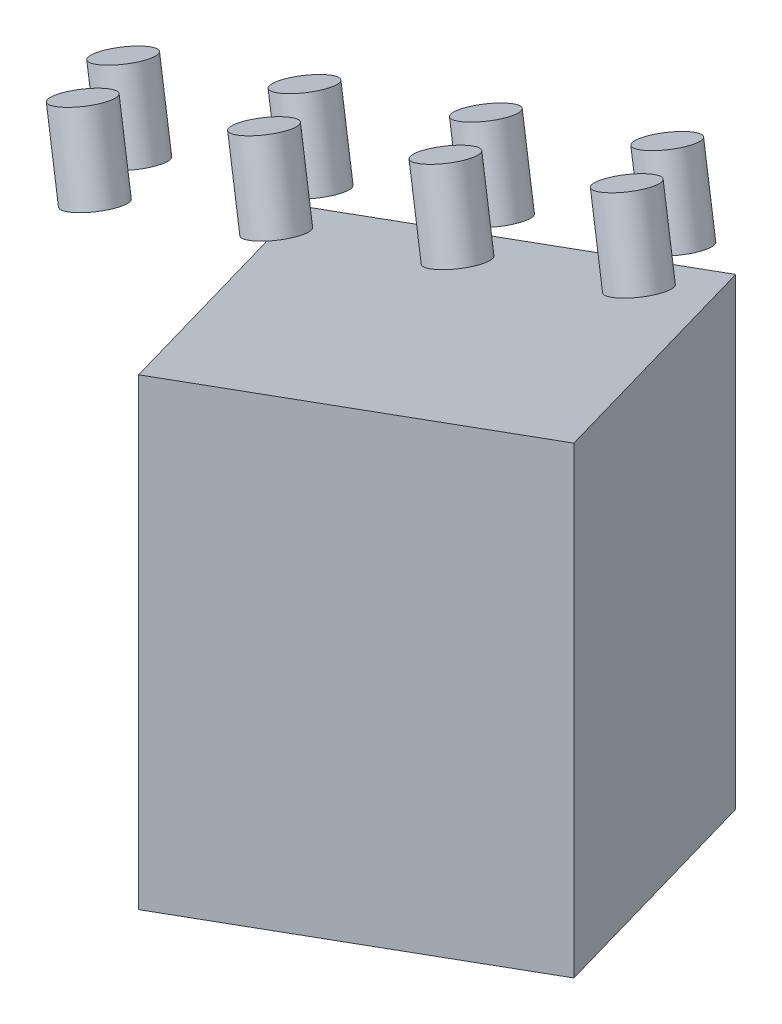
ISO-10303-21;
HEADER;
FILE_DESCRIPTION(('STEP AP214'),'2;1');
FILE_NAME('part.step','',(''),(''),'','','');
FILE_SCHEMA(('AUTOMOTIVE_DESIGN { 1 0 10303 214 1 1 1 1 }'));
ENDSEC;
DATA;
#1=APPLICATION_CONTEXT('core data for automotive mechanical design processes');
#2=APPLICATION_PROTOCOL_DEFINITION('international standard','automotive_design',2000,#1);
#3=PRODUCT_CONTEXT('',#1,'mechanical');
#4=PRODUCT('Part','Part','',(#3));
#5=PRODUCT_RELATED_PRODUCT_CATEGORY('part','',(#4));
#6=PRODUCT_DEFINITION_FORMATION('','',#4);
#7=PRODUCT_DEFINITION_CONTEXT('part definition',#1,'design');
#8=PRODUCT_DEFINITION('design','',#6,#7);
#9=PRODUCT_DEFINITION_SHAPE('','',#8);
#10=(LENGTH_UNIT() NAMED_UNIT(*) SI_UNIT(.MILLI.,.METRE.));
#11=(NAMED_UNIT(*) PLANE_ANGLE_UNIT() SI_UNIT($,.RADIAN.));
#12=(NAMED_UNIT(*) SI_UNIT($,.STERADIAN.) SOLID_ANGLE_UNIT());
#13=UNCERTAINTY_MEASURE_WITH_UNIT(LENGTH_MEASURE(1.E-05),#10,'distance_accuracy_value','');
#14=(GEOMETRIC_REPRESENTATION_CONTEXT(3) GLOBAL_UNCERTAINTY_ASSIGNED_CONTEXT((#13)) GLOBAL_UNIT_ASSIGNED_CONTEXT((#10,
#11,#12)) REPRESENTATION_CONTEXT('',''));
#15=CARTESIAN_POINT('',(0.,0.,0.));
#16=DIRECTION('',(0.,0.,1.));
#17=DIRECTION('',(1.,0.,0.));
#18=AXIS2_PLACEMENT_3D('',#15,#16,#17);
#19=CARTESIAN_POINT('',(-29.5986839364483,58.7634470395438,-6.62993275582684));
#20=DIRECTION('',(0.3365382859498,-0.924631341429047,0.178322361292947));
#21=DIRECTION('',(0.939692620785909,0.342020143325666,0.));
#22=AXIS2_PLACEMENT_3D('',#19,#20,#21);
#23=CYLINDRICAL_SURFACE('',#22,3.35836070254508);
#24=CARTESIAN_POINT('',(-29.5986839364483,58.7634470395438,-6.62993275582684));
#25=DIRECTION('',(-0.3365382859498,0.924631341429047,-0.178322361292947));
#26=DIRECTION('',(-0.939692620785909,-0.342020143325666,0.));
#27=AXIS2_PLACEMENT_3D('',#24,#25,#26);
#28=CIRCLE('',#27,3.35836070254508);
#29=CARTESIAN_POINT('',(-32.7545107065673,57.6148200307201,-6.62993275582684));
#30=VERTEX_POINT('',#29);
#31=EDGE_CURVE('E11',#30,#30,#28,.T.);
#32=ORIENTED_EDGE('',*,*,#31,.F.);
#33=EDGE_LOOP('',(#32));
#34=FACE_BOUND('',#33,.T.);
#35=CARTESIAN_POINT('',(-26.2333010769503,49.5171336252533,-4.84670914289737));
#36=DIRECTION('',(-0.3365382859498,0.924631341429047,-0.178322361292947));
#37=DIRECTION('',(-0.939692620785909,-0.342020143325666,0.));
#38=AXIS2_PLACEMENT_3D('',#35,#36,#37);
#39=CIRCLE('',#38,3.35836070254508);
#40=CARTESIAN_POINT('',(-29.3891278470693,48.3685066164296,-4.84670914289737));
#41=VERTEX_POINT('',#40);
#42=EDGE_CURVE('E49',#41,#41,#39,.T.);
#43=ORIENTED_EDGE('',*,*,#42,.T.);
#44=EDGE_LOOP('',(#43));
#45=FACE_BOUND('',#44,.T.);
#46=ADVANCED_FACE('F46',(#34,#45),#23,.T.);
#47=CARTESIAN_POINT('',(-29.5986839364483,58.7634470395438,-6.62993275582684));
#48=DIRECTION('',(-0.3365382859498,0.924631341429047,-0.178322361292947));
#49=DIRECTION('',(-0.939692620785909,-0.342020143325666,0.));
#50=AXIS2_PLACEMENT_3D('',#47,#48,#49);
#51=PLANE('',#50);
#52=ORIENTED_EDGE('',*,*,#31,.T.);
#53=EDGE_LOOP('',(#52));
#54=FACE_BOUND('',#53,.T.);
#55=ADVANCED_FACE('F61',(#54),#51,.T.);
#56=CARTESIAN_POINT('',(-26.2333010769503,49.5171336252533,-4.84670914289737));
#57=DIRECTION('',(-0.3365382859498,0.924631341429047,-0.178322361292947));
#58=DIRECTION('',(-0.939692620785909,-0.342020143325666,0.));
#59=AXIS2_PLACEMENT_3D('',#56,#57,#58);
#60=PLANE('',#59);
#61=ORIENTED_EDGE('',*,*,#42,.F.);
#62=EDGE_LOOP('',(#61));
#63=FACE_BOUND('',#62,.T.);
#64=ADVANCED_FACE('F59',(#63),#60,.F.);
#65=CLOSED_SHELL('',(#46,#55,#64));
#66=MANIFOLD_SOLID_BREP('B2',#65);
#67=CARTESIAN_POINT('',(-22.550989280554,63.6982959646013,5.65734790850802));
#68=DIRECTION('',(0.3365382859498,-0.924631341429047,0.178322361292947));
#69=DIRECTION('',(0.939692620785909,0.342020143325666,0.));
#70=AXIS2_PLACEMENT_3D('',#67,#68,#69);
#71=CYLINDRICAL_SURFACE('',#70,3.35836070254508);
#72=CARTESIAN_POINT('',(-22.550989280554,63.6982959646013,5.65734790850802));
#73=DIRECTION('',(-0.3365382859498,0.924631341429047,-0.178322361292947));
#74=DIRECTION('',(-0.939692620785909,-0.342020143325666,0.));
#75=AXIS2_PLACEMENT_3D('',#72,#73,#74);
#76=CIRCLE('',#75,3.35836070254508);
#77=CARTESIAN_POINT('',(-25.706816050673,62.5496689557776,5.65734790850802));
#78=VERTEX_POINT('',#77);
#79=EDGE_CURVE('E45',#78,#78,#76,.T.);
#80=ORIENTED_EDGE('',*,*,#79,.F.);
#81=EDGE_LOOP('',(#80));
#82=FACE_BOUND('',#81,.T.);
#83=CARTESIAN_POINT('',(-19.185606421056,54.4519825503108,7.44057152143749));
#84=DIRECTION('',(-0.3365382859498,0.924631341429047,-0.178322361292947));
#85=DIRECTION('',(-0.939692620785909,-0.342020143325666,0.));
#86=AXIS2_PLACEMENT_3D('',#83,#84,#85);
#87=CIRCLE('',#86,3.35836070254508);
#88=CARTESIAN_POINT('',(-22.3414331911749,53.3033555414871,7.44057152143749));
#89=VERTEX_POINT('',#88);
#90=EDGE_CURVE('E98',#89,#89,#87,.T.);
#91=ORIENTED_EDGE('',*,*,#90,.T.);
#92=EDGE_LOOP('',(#91));
#93=FACE_BOUND('',#92,.T.);
#94=ADVANCED_FACE('F95',(#82,#93),#71,.T.);
#95=CARTESIAN_POINT('',(-22.550989280554,63.6982959646013,5.65734790850802));
#96=DIRECTION('',(-0.3365382859498,0.924631341429047,-0.178322361292947));
#97=DIRECTION('',(-0.939692620785909,-0.342020143325666,0.));
#98=AXIS2_PLACEMENT_3D('',#95,#96,#97);
#99=PLANE('',#98);
#100=ORIENTED_EDGE('',*,*,#79,.T.);
#101=EDGE_LOOP('',(#100));
#102=FACE_BOUND('',#101,.T.);
#103=ADVANCED_FACE('F110',(#102),#99,.T.);
#104=CARTESIAN_POINT('',(-19.185606421056,54.4519825503108,7.44057152143749));
#105=DIRECTION('',(-0.3365382859498,0.924631341429047,-0.178322361292947));
#106=DIRECTION('',(-0.939692620785909,-0.342020143325666,0.));
#107=AXIS2_PLACEMENT_3D('',#104,#105,#106);
#108=PLANE('',#107);
#109=ORIENTED_EDGE('',*,*,#90,.F.);
#110=EDGE_LOOP('',(#109));
#111=FACE_BOUND('',#110,.T.);
#112=ADVANCED_FACE('F108',(#111),#108,.F.);
#113=CLOSED_SHELL('',(#94,#103,#112));
#114=MANIFOLD_SOLID_BREP('B6',#113);
#115=CARTESIAN_POINT('',(-6.10636841680053,67.3139506226855,-6.62993275582684));
#116=DIRECTION('',(0.3365382859498,-0.924631341429047,0.178322361292947));
#117=DIRECTION('',(0.939692620785909,0.342020143325666,0.));
#118=AXIS2_PLACEMENT_3D('',#115,#116,#117);
#119=CYLINDRICAL_SURFACE('',#118,3.35836070254508);
#120=CARTESIAN_POINT('',(-6.10636841680053,67.3139506226855,-6.62993275582684));
#121=DIRECTION('',(-0.3365382859498,0.924631341429047,-0.178322361292947));
#122=DIRECTION('',(-0.939692620785909,-0.342020143325666,0.));
#123=AXIS2_PLACEMENT_3D('',#120,#121,#122);
#124=CIRCLE('',#123,3.35836070254508);
#125=CARTESIAN_POINT('',(-9.26219518691953,66.1653236138617,-6.62993275582684));
#126=VERTEX_POINT('',#125);
#127=EDGE_CURVE('E94',#126,#126,#124,.T.);
#128=ORIENTED_EDGE('',*,*,#127,.F.);
#129=EDGE_LOOP('',(#128));
#130=FACE_BOUND('',#129,.T.);
#131=CARTESIAN_POINT('',(-2.74098555730253,58.067637208395,-4.84670914289737));
#132=DIRECTION('',(-0.3365382859498,0.924631341429047,-0.178322361292947));
#133=DIRECTION('',(-0.939692620785909,-0.342020143325666,0.));
#134=AXIS2_PLACEMENT_3D('',#131,#132,#133);
#135=CIRCLE('',#134,3.35836070254508);
#136=CARTESIAN_POINT('',(-5.89681232742153,56.9190101995712,-4.84670914289737));
#137=VERTEX_POINT('',#136);
#138=EDGE_CURVE('E147',#137,#137,#135,.T.);
#139=ORIENTED_EDGE('',*,*,#138,.T.);
#140=EDGE_LOOP('',(#139));
#141=FACE_BOUND('',#140,.T.);
#142=ADVANCED_FACE('F144',(#130,#141),#119,.T.);
#143=CARTESIAN_POINT('',(-6.10636841680053,67.3139506226855,-6.62993275582684));
#144=DIRECTION('',(-0.3365382859498,0.924631341429047,-0.178322361292947));
#145=DIRECTION('',(-0.939692620785909,-0.342020143325666,0.));
#146=AXIS2_PLACEMENT_3D('',#143,#144,#145);
#147=PLANE('',#146);
#148=ORIENTED_EDGE('',*,*,#127,.T.);
#149=EDGE_LOOP('',(#148));
#150=FACE_BOUND('',#149,.T.);
#151=ADVANCED_FACE('F159',(#150),#147,.T.);
#152=CARTESIAN_POINT('',(-2.74098555730253,58.067637208395,-4.84670914289737));
#153=DIRECTION('',(-0.3365382859498,0.924631341429047,-0.178322361292947));
#154=DIRECTION('',(-0.939692620785909,-0.342020143325666,0.));
#155=AXIS2_PLACEMENT_3D('',#152,#153,#154);
#156=PLANE('',#155);
#157=ORIENTED_EDGE('',*,*,#138,.F.);
#158=EDGE_LOOP('',(#157));
#159=FACE_BOUND('',#158,.T.);
#160=ADVANCED_FACE('F157',(#159),#156,.F.);
#161=CLOSED_SHELL('',(#142,#151,#160));
#162=MANIFOLD_SOLID_BREP('B40',#161);
#163=CARTESIAN_POINT('',(0.941326239093785,72.248799547743,5.65734790850802));
#164=DIRECTION('',(0.3365382859498,-0.924631341429047,0.178322361292947));
#165=DIRECTION('',(0.939692620785909,0.342020143325666,0.));
#166=AXIS2_PLACEMENT_3D('',#163,#164,#165);
#167=CYLINDRICAL_SURFACE('',#166,3.35836070254508);
#168=CARTESIAN_POINT('',(0.941326239093785,72.248799547743,5.65734790850802));
#169=DIRECTION('',(-0.3365382859498,0.924631341429047,-0.178322361292947));
#170=DIRECTION('',(-0.939692620785909,-0.342020143325666,0.));
#171=AXIS2_PLACEMENT_3D('',#168,#169,#170);
#172=CIRCLE('',#171,3.35836070254508);
#173=CARTESIAN_POINT('',(-2.21450053102521,71.1001725389192,5.65734790850802));
#174=VERTEX_POINT('',#173);
#175=EDGE_CURVE('E143',#174,#174,#172,.T.);
#176=ORIENTED_EDGE('',*,*,#175,.F.);
#177=EDGE_LOOP('',(#176));
#178=FACE_BOUND('',#177,.T.);
#179=CARTESIAN_POINT('',(4.30670909859179,63.0024861334525,7.44057152143749));
#180=DIRECTION('',(-0.3365382859498,0.924631341429047,-0.178322361292947));
#181=DIRECTION('',(-0.939692620785909,-0.342020143325666,0.));
#182=AXIS2_PLACEMENT_3D('',#179,#180,#181);
#183=CIRCLE('',#182,3.35836070254508);
#184=CARTESIAN_POINT('',(1.15088232847279,61.8538591246288,7.44057152143749));
#185=VERTEX_POINT('',#184);
#186=EDGE_CURVE('E196',#185,#185,#183,.T.);
#187=ORIENTED_EDGE('',*,*,#186,.T.);
#188=EDGE_LOOP('',(#187));
#189=FACE_BOUND('',#188,.T.);
#190=ADVANCED_FACE('F193',(#178,#189),#167,.T.);
#191=CARTESIAN_POINT('',(0.941326239093785,72.248799547743,5.65734790850802));
#192=DIRECTION('',(-0.3365382859498,0.924631341429047,-0.178322361292947));
#193=DIRECTION('',(-0.939692620785909,-0.342020143325666,0.));
#194=AXIS2_PLACEMENT_3D('',#191,#192,#193);
#195=PLANE('',#194);
#196=ORIENTED_EDGE('',*,*,#175,.T.);
#197=EDGE_LOOP('',(#196));
#198=FACE_BOUND('',#197,.T.);
#199=ADVANCED_FACE('F208',(#198),#195,.T.);
#200=CARTESIAN_POINT('',(4.30670909859179,63.0024861334525,7.44057152143749));
#201=DIRECTION('',(-0.3365382859498,0.924631341429047,-0.178322361292947));
#202=DIRECTION('',(-0.939692620785909,-0.342020143325666,0.));
#203=AXIS2_PLACEMENT_3D('',#200,#201,#202);
#204=PLANE('',#203);
#205=ORIENTED_EDGE('',*,*,#186,.F.);
#206=EDGE_LOOP('',(#205));
#207=FACE_BOUND('',#206,.T.);
#208=ADVANCED_FACE('F206',(#207),#204,.F.);
#209=CLOSED_SHELL('',(#190,#199,#208));
#210=MANIFOLD_SOLID_BREP('B89',#209);
#211=CARTESIAN_POINT('',(17.3859471028472,75.8644542058271,-6.62993275582684));
#212=DIRECTION('',(0.3365382859498,-0.924631341429047,0.178322361292947));
#213=DIRECTION('',(0.939692620785909,0.342020143325666,0.));
#214=AXIS2_PLACEMENT_3D('',#211,#212,#213);
#215=CYLINDRICAL_SURFACE('',#214,3.35836070254508);
#216=CARTESIAN_POINT('',(17.3859471028472,75.8644542058271,-6.62993275582684));
#217=DIRECTION('',(-0.3365382859498,0.924631341429047,-0.178322361292947));
#218=DIRECTION('',(-0.939692620785909,-0.342020143325666,0.));
#219=AXIS2_PLACEMENT_3D('',#216,#217,#218);
#220=CIRCLE('',#219,3.35836070254508);
#221=CARTESIAN_POINT('',(14.2301203327282,74.7158271970034,-6.62993275582684));
#222=VERTEX_POINT('',#221);
#223=EDGE_CURVE('E192',#222,#222,#220,.T.);
#224=ORIENTED_EDGE('',*,*,#223,.F.);
#225=EDGE_LOOP('',(#224));
#226=FACE_BOUND('',#225,.T.);
#227=CARTESIAN_POINT('',(20.7513299623452,66.6181407915367,-4.84670914289737));
#228=DIRECTION('',(-0.3365382859498,0.924631341429047,-0.178322361292947));
#229=DIRECTION('',(-0.939692620785909,-0.342020143325666,0.));
#230=AXIS2_PLACEMENT_3D('',#227,#228,#229);
#231=CIRCLE('',#230,3.35836070254508);
#232=CARTESIAN_POINT('',(17.5955031922262,65.4695137827129,-4.84670914289737));
#233=VERTEX_POINT('',#232);
#234=EDGE_CURVE('E245',#233,#233,#231,.T.);
#235=ORIENTED_EDGE('',*,*,#234,.T.);
#236=EDGE_LOOP('',(#235));
#237=FACE_BOUND('',#236,.T.);
#238=ADVANCED_FACE('F242',(#226,#237),#215,.T.);
#239=CARTESIAN_POINT('',(17.3859471028472,75.8644542058271,-6.62993275582684));
#240=DIRECTION('',(-0.3365382859498,0.924631341429047,-0.178322361292947));
#241=DIRECTION('',(-0.939692620785909,-0.342020143325666,0.));
#242=AXIS2_PLACEMENT_3D('',#239,#240,#241);
#243=PLANE('',#242);
#244=ORIENTED_EDGE('',*,*,#223,.T.);
#245=EDGE_LOOP('',(#244));
#246=FACE_BOUND('',#245,.T.);
#247=ADVANCED_FACE('F257',(#246),#243,.T.);
#248=CARTESIAN_POINT('',(20.7513299623452,66.6181407915367,-4.84670914289737));
#249=DIRECTION('',(-0.3365382859498,0.924631341429047,-0.178322361292947));
#250=DIRECTION('',(-0.939692620785909,-0.342020143325666,0.));
#251=AXIS2_PLACEMENT_3D('',#248,#249,#250);
#252=PLANE('',#251);
#253=ORIENTED_EDGE('',*,*,#234,.F.);
#254=EDGE_LOOP('',(#253));
#255=FACE_BOUND('',#254,.T.);
#256=ADVANCED_FACE('F255',(#255),#252,.F.);
#257=CLOSED_SHELL('',(#238,#247,#256));
#258=MANIFOLD_SOLID_BREP('B138',#257);
#259=CARTESIAN_POINT('',(24.4336417587415,80.7993031308846,5.65734790850802));
#260=DIRECTION('',(0.3365382859498,-0.924631341429047,0.178322361292947));
#261=DIRECTION('',(0.939692620785909,0.342020143325666,0.));
#262=AXIS2_PLACEMENT_3D('',#259,#260,#261);
#263=CYLINDRICAL_SURFACE('',#262,3.35836070254508);
#264=CARTESIAN_POINT('',(24.4336417587415,80.7993031308846,5.65734790850802));
#265=DIRECTION('',(-0.3365382859498,0.924631341429047,-0.178322361292947));
#266=DIRECTION('',(-0.939692620785909,-0.342020143325666,0.));
#267=AXIS2_PLACEMENT_3D('',#264,#265,#266);
#268=CIRCLE('',#267,3.35836070254508);
#269=CARTESIAN_POINT('',(21.2778149886225,79.6506761220609,5.65734790850802));
#270=VERTEX_POINT('',#269);
#271=EDGE_CURVE('E241',#270,#270,#268,.T.);
#272=ORIENTED_EDGE('',*,*,#271,.F.);
#273=EDGE_LOOP('',(#272));
#274=FACE_BOUND('',#273,.T.);
#275=CARTESIAN_POINT('',(27.7990246182395,71.5529897165942,7.44057152143749));
#276=DIRECTION('',(-0.3365382859498,0.924631341429047,-0.178322361292947));
#277=DIRECTION('',(-0.939692620785909,-0.342020143325666,0.));
#278=AXIS2_PLACEMENT_3D('',#275,#276,#277);
#279=CIRCLE('',#278,3.35836070254508);
#280=CARTESIAN_POINT('',(24.6431978481205,70.4043627077704,7.44057152143749));
#281=VERTEX_POINT('',#280);
#282=EDGE_CURVE('E294',#281,#281,#279,.T.);
#283=ORIENTED_EDGE('',*,*,#282,.T.);
#284=EDGE_LOOP('',(#283));
#285=FACE_BOUND('',#284,.T.);
#286=ADVANCED_FACE('F291',(#274,#285),#263,.T.);
#287=CARTESIAN_POINT('',(24.4336417587415,80.7993031308846,5.65734790850802));
#288=DIRECTION('',(-0.3365382859498,0.924631341429047,-0.178322361292947));
#289=DIRECTION('',(-0.939692620785909,-0.342020143325666,0.));
#290=AXIS2_PLACEMENT_3D('',#287,#288,#289);
#291=PLANE('',#290);
#292=ORIENTED_EDGE('',*,*,#271,.T.);
#293=EDGE_LOOP('',(#292));
#294=FACE_BOUND('',#293,.T.);
#295=ADVANCED_FACE('F306',(#294),#291,.T.);
#296=CARTESIAN_POINT('',(27.7990246182395,71.5529897165942,7.44057152143749));
#297=DIRECTION('',(-0.3365382859498,0.924631341429047,-0.178322361292947));
#298=DIRECTION('',(-0.939692620785909,-0.342020143325666,0.));
#299=AXIS2_PLACEMENT_3D('',#296,#297,#298);
#300=PLANE('',#299);
#301=ORIENTED_EDGE('',*,*,#282,.F.);
#302=EDGE_LOOP('',(#301));
#303=FACE_BOUND('',#302,.T.);
#304=ADVANCED_FACE('F304',(#303),#300,.F.);
#305=CLOSED_SHELL('',(#286,#295,#304));
#306=MANIFOLD_SOLID_BREP('B187',#305);
#307=CARTESIAN_POINT('',(40.8782626224949,84.4149577889688,-6.62993275582684));
#308=DIRECTION('',(0.3365382859498,-0.924631341429047,0.178322361292947));
#309=DIRECTION('',(0.939692620785909,0.342020143325666,0.));
#310=AXIS2_PLACEMENT_3D('',#307,#308,#309);
#311=CYLINDRICAL_SURFACE('',#310,3.35836070254508);
#312=CARTESIAN_POINT('',(40.8782626224949,84.4149577889688,-6.62993275582684));
#313=DIRECTION('',(-0.3365382859498,0.924631341429047,-0.178322361292947));
#314=DIRECTION('',(-0.939692620785909,-0.342020143325666,0.));
#315=AXIS2_PLACEMENT_3D('',#312,#313,#314);
#316=CIRCLE('',#315,3.35836070254508);
#317=CARTESIAN_POINT('',(37.7224358523759,83.266330780145,-6.62993275582684));
#318=VERTEX_POINT('',#317);
#319=EDGE_CURVE('E290',#318,#318,#316,.T.);
#320=ORIENTED_EDGE('',*,*,#319,.F.);
#321=EDGE_LOOP('',(#320));
#322=FACE_BOUND('',#321,.T.);
#323=CARTESIAN_POINT('',(44.2436454819929,75.1686443746783,-4.84670914289737));
#324=DIRECTION('',(-0.3365382859498,0.924631341429047,-0.178322361292947));
#325=DIRECTION('',(-0.939692620785909,-0.342020143325666,0.));
#326=AXIS2_PLACEMENT_3D('',#323,#324,#325);
#327=CIRCLE('',#326,3.35836070254508);
#328=CARTESIAN_POINT('',(41.087818711874,74.0200173658545,-4.84670914289737));
#329=VERTEX_POINT('',#328);
#330=EDGE_CURVE('E343',#329,#329,#327,.T.);
#331=ORIENTED_EDGE('',*,*,#330,.T.);
#332=EDGE_LOOP('',(#331));
#333=FACE_BOUND('',#332,.T.);
#334=ADVANCED_FACE('F340',(#322,#333),#311,.T.);
#335=CARTESIAN_POINT('',(40.8782626224949,84.4149577889688,-6.62993275582684));
#336=DIRECTION('',(-0.3365382859498,0.924631341429047,-0.178322361292947));
#337=DIRECTION('',(-0.939692620785909,-0.342020143325666,0.));
#338=AXIS2_PLACEMENT_3D('',#335,#336,#337);
#339=PLANE('',#338);
#340=ORIENTED_EDGE('',*,*,#319,.T.);
#341=EDGE_LOOP('',(#340));
#342=FACE_BOUND('',#341,.T.);
#343=ADVANCED_FACE('F355',(#342),#339,.T.);
#344=CARTESIAN_POINT('',(44.2436454819929,75.1686443746783,-4.84670914289737));
#345=DIRECTION('',(-0.3365382859498,0.924631341429047,-0.178322361292947));
#346=DIRECTION('',(-0.939692620785909,-0.342020143325666,0.));
#347=AXIS2_PLACEMENT_3D('',#344,#345,#346);
#348=PLANE('',#347);
#349=ORIENTED_EDGE('',*,*,#330,.F.);
#350=EDGE_LOOP('',(#349));
#351=FACE_BOUND('',#350,.T.);
#352=ADVANCED_FACE('F353',(#351),#348,.F.);
#353=CLOSED_SHELL('',(#334,#343,#352));
#354=MANIFOLD_SOLID_BREP('B236',#353);
#355=CARTESIAN_POINT('',(47.9259572783893,89.3498067140263,5.65734790850802));
#356=DIRECTION('',(0.3365382859498,-0.924631341429047,0.178322361292947));
#357=DIRECTION('',(0.939692620785909,0.342020143325666,0.));
#358=AXIS2_PLACEMENT_3D('',#355,#356,#357);
#359=CYLINDRICAL_SURFACE('',#358,3.35836070254508);
#360=CARTESIAN_POINT('',(47.9259572783893,89.3498067140263,5.65734790850802));
#361=DIRECTION('',(-0.3365382859498,0.924631341429047,-0.178322361292947));
#362=DIRECTION('',(-0.939692620785909,-0.342020143325666,0.));
#363=AXIS2_PLACEMENT_3D('',#360,#361,#362);
#364=CIRCLE('',#363,3.35836070254508);
#365=CARTESIAN_POINT('',(44.7701305082703,88.2011797052025,5.65734790850802));
#366=VERTEX_POINT('',#365);
#367=EDGE_CURVE('E339',#366,#366,#364,.T.);
#368=ORIENTED_EDGE('',*,*,#367,.F.);
#369=EDGE_LOOP('',(#368));
#370=FACE_BOUND('',#369,.T.);
#371=CARTESIAN_POINT('',(51.2913401378873,80.1034932997358,7.44057152143749));
#372=DIRECTION('',(-0.3365382859498,0.924631341429047,-0.178322361292947));
#373=DIRECTION('',(-0.939692620785909,-0.342020143325666,0.));
#374=AXIS2_PLACEMENT_3D('',#371,#372,#373);
#375=CIRCLE('',#374,3.35836070254508);
#376=CARTESIAN_POINT('',(48.1355133677683,78.9548662909121,7.44057152143749));
#377=VERTEX_POINT('',#376);
#378=EDGE_CURVE('E392',#377,#377,#375,.T.);
#379=ORIENTED_EDGE('',*,*,#378,.T.);
#380=EDGE_LOOP('',(#379));
#381=FACE_BOUND('',#380,.T.);
#382=ADVANCED_FACE('F389',(#370,#381),#359,.T.);
#383=CARTESIAN_POINT('',(47.9259572783893,89.3498067140263,5.65734790850802));
#384=DIRECTION('',(-0.3365382859498,0.924631341429047,-0.178322361292947));
#385=DIRECTION('',(-0.939692620785909,-0.342020143325666,0.));
#386=AXIS2_PLACEMENT_3D('',#383,#384,#385);
#387=PLANE('',#386);
#388=ORIENTED_EDGE('',*,*,#367,.T.);
#389=EDGE_LOOP('',(#388));
#390=FACE_BOUND('',#389,.T.);
#391=ADVANCED_FACE('F404',(#390),#387,.T.);
#392=CARTESIAN_POINT('',(51.2913401378873,80.1034932997358,7.44057152143749));
#393=DIRECTION('',(-0.3365382859498,0.924631341429047,-0.178322361292947));
#394=DIRECTION('',(-0.939692620785909,-0.342020143325666,0.));
#395=AXIS2_PLACEMENT_3D('',#392,#393,#394);
#396=PLANE('',#395);
#397=ORIENTED_EDGE('',*,*,#378,.F.);
#398=EDGE_LOOP('',(#397));
#399=FACE_BOUND('',#398,.T.);
#400=ADVANCED_FACE('F402',(#399),#396,.F.);
#401=CLOSED_SHELL('',(#382,#391,#400));
#402=MANIFOLD_SOLID_BREP('B285',#401);
#403=CARTESIAN_POINT('',(0.,0.,0.));
#404=DIRECTION('',(0.,0.,1.));
#405=DIRECTION('',(1.,0.,0.));
#406=AXIS2_PLACEMENT_3D('',#403,#404,#405);
#407=PLANE('',#406);
#408=DIRECTION('',(0.939692620785909,0.342020143325666,0.));
#409=VECTOR('',#408,1.);
#410=CARTESIAN_POINT('',(0.,0.,0.));
#411=LINE('',#410,#409);
#412=CARTESIAN_POINT('',(0.,0.,0.));
#413=VERTEX_POINT('',#412);
#414=CARTESIAN_POINT('',(56.3815572471545,20.52120859954,0.));
#415=VERTEX_POINT('',#414);
#416=EDGE_CURVE('E472',#413,#415,#411,.T.);
#417=ORIENTED_EDGE('',*,*,#416,.F.);
#418=DIRECTION('',(0.,-1.,0.));
#419=VECTOR('',#418,1.);
#420=CARTESIAN_POINT('',(0.,0.,0.));
#421=LINE('',#420,#419);
#422=CARTESIAN_POINT('',(0.,60.,0.));
#423=VERTEX_POINT('',#422);
#424=EDGE_CURVE('E460',#423,#413,#421,.T.);
#425=ORIENTED_EDGE('',*,*,#424,.F.);
#426=DIRECTION('',(-0.939692620785909,-0.342020143325666,0.));
#427=VECTOR('',#426,1.);
#428=CARTESIAN_POINT('',(0.,60.,0.));
#429=LINE('',#428,#427);
#430=CARTESIAN_POINT('',(56.3815572471546,80.52120859954,0.));
#431=VERTEX_POINT('',#430);
#432=EDGE_CURVE('E465',#431,#423,#429,.T.);
#433=ORIENTED_EDGE('',*,*,#432,.F.);
#434=DIRECTION('',(0.,1.,0.));
#435=VECTOR('',#434,1.);
#436=CARTESIAN_POINT('',(56.3815572471545,20.52120859954,0.));
#437=LINE('',#436,#435);
#438=EDGE_CURVE('E469',#415,#431,#437,.T.);
#439=ORIENTED_EDGE('',*,*,#438,.F.);
#440=EDGE_LOOP('',(#417,#425,#433,#439));
#441=FACE_BOUND('',#440,.T.);
#442=ADVANCED_FACE('F429',(#441),#407,.F.);
#443=CARTESIAN_POINT('',(28.1907786235773,19.73939570023,49.1491226573394));
#444=DIRECTION('',(0.,0.,1.));
#445=DIRECTION('',(1.,0.,0.));
#446=AXIS2_PLACEMENT_3D('',#443,#444,#445);
#447=PLANE('',#446);
#448=DIRECTION('',(0.939692620785909,0.342020143325666,0.));
#449=VECTOR('',#448,1.);
#450=CARTESIAN_POINT('',(28.1907786235773,19.73939570023,49.1491226573394));
#451=LINE('',#450,#449);
#452=CARTESIAN_POINT('',(28.1907786235773,19.73939570023,49.1491226573394));
#453=VERTEX_POINT('',#452);
#454=CARTESIAN_POINT('',(84.5723358707318,40.26060429977,49.1491226573394));
#455=VERTEX_POINT('',#454);
#456=EDGE_CURVE('E488',#453,#455,#451,.T.);
#457=ORIENTED_EDGE('',*,*,#456,.T.);
#458=DIRECTION('',(0.,1.,0.));
#459=VECTOR('',#458,1.);
#460=CARTESIAN_POINT('',(84.5723358707318,40.26060429977,49.1491226573394));
#461=LINE('',#460,#459);
#462=CARTESIAN_POINT('',(84.5723358707318,100.26060429977,49.1491226573394));
#463=VERTEX_POINT('',#462);
#464=EDGE_CURVE('E449',#455,#463,#461,.T.);
#465=ORIENTED_EDGE('',*,*,#464,.T.);
#466=DIRECTION('',(-0.939692620785909,-0.342020143325666,0.));
#467=VECTOR('',#466,1.);
#468=CARTESIAN_POINT('',(28.1907786235773,79.73939570023,49.1491226573394));
#469=LINE('',#468,#467);
#470=CARTESIAN_POINT('',(28.1907786235773,79.73939570023,49.1491226573394));
#471=VERTEX_POINT('',#470);
#472=EDGE_CURVE('E443',#463,#471,#469,.T.);
#473=ORIENTED_EDGE('',*,*,#472,.T.);
#474=DIRECTION('',(0.,-1.,0.));
#475=VECTOR('',#474,1.);
#476=CARTESIAN_POINT('',(28.1907786235773,19.73939570023,49.1491226573394));
#477=LINE('',#476,#475);
#478=EDGE_CURVE('E387',#471,#453,#477,.T.);
#479=ORIENTED_EDGE('',*,*,#478,.T.);
#480=EDGE_LOOP('',(#457,#465,#473,#479));
#481=FACE_BOUND('',#480,.T.);
#482=ADVANCED_FACE('F522',(#481),#447,.T.);
#483=CARTESIAN_POINT('',(0.,0.,0.));
#484=DIRECTION('',(0.3365382859498,-0.924631341429047,0.178322361292947));
#485=DIRECTION('',(0.939692620785909,0.342020143325666,0.));
#486=AXIS2_PLACEMENT_3D('',#483,#484,#485);
#487=PLANE('',#486);
#488=DIRECTION('',(0.469846310392955,0.328989928337167,0.819152044288991));
#489=VECTOR('',#488,1.);
#490=CARTESIAN_POINT('',(56.3815572471545,20.52120859954,0.));
#491=LINE('',#490,#489);
#492=EDGE_CURVE('E492',#415,#455,#491,.T.);
#493=ORIENTED_EDGE('',*,*,#492,.T.);
#494=ORIENTED_EDGE('',*,*,#456,.F.);
#495=DIRECTION('',(0.469846310392955,0.328989928337167,0.819152044288991));
#496=VECTOR('',#495,1.);
#497=CARTESIAN_POINT('',(0.,0.,0.));
#498=LINE('',#497,#496);
#499=EDGE_CURVE('E483',#413,#453,#498,.T.);
#500=ORIENTED_EDGE('',*,*,#499,.F.);
#501=ORIENTED_EDGE('',*,*,#416,.T.);
#502=EDGE_LOOP('',(#493,#494,#500,#501));
#503=FACE_BOUND('',#502,.T.);
#504=ADVANCED_FACE('F487',(#503),#487,.T.);
#505=CARTESIAN_POINT('',(56.3815572471545,20.52120859954,0.));
#506=DIRECTION('',(0.867439421552547,0.,-0.497542812164524));
#507=DIRECTION('',(-0.497542812164524,0.,-0.867439421552547));
#508=AXIS2_PLACEMENT_3D('',#505,#506,#507);
#509=PLANE('',#508);
#510=DIRECTION('',(0.469846310392955,0.328989928337167,0.819152044288991));
#511=VECTOR('',#510,1.);
#512=CARTESIAN_POINT('',(56.3815572471546,80.52120859954,0.));
#513=LINE('',#512,#511);
#514=EDGE_CURVE('E500',#431,#463,#513,.T.);
#515=ORIENTED_EDGE('',*,*,#514,.T.);
#516=ORIENTED_EDGE('',*,*,#464,.F.);
#517=ORIENTED_EDGE('',*,*,#492,.F.);
#518=ORIENTED_EDGE('',*,*,#438,.T.);
#519=EDGE_LOOP('',(#515,#516,#517,#518));
#520=FACE_BOUND('',#519,.T.);
#521=ADVANCED_FACE('F513',(#520),#509,.T.);
#522=CARTESIAN_POINT('',(0.,60.,0.));
#523=DIRECTION('',(-0.3365382859498,0.924631341429047,-0.178322361292947));
#524=DIRECTION('',(-0.939692620785909,-0.342020143325666,0.));
#525=AXIS2_PLACEMENT_3D('',#522,#523,#524);
#526=PLANE('',#525);
#527=DIRECTION('',(0.469846310392955,0.328989928337167,0.819152044288991));
#528=VECTOR('',#527,1.);
#529=CARTESIAN_POINT('',(0.,60.,0.));
#530=LINE('',#529,#528);
#531=EDGE_CURVE('E437',#423,#471,#530,.T.);
#532=ORIENTED_EDGE('',*,*,#531,.T.);
#533=ORIENTED_EDGE('',*,*,#472,.F.);
#534=ORIENTED_EDGE('',*,*,#514,.F.);
#535=ORIENTED_EDGE('',*,*,#432,.T.);
#536=EDGE_LOOP('',(#532,#533,#534,#535));
#537=FACE_BOUND('',#536,.T.);
#538=ADVANCED_FACE('F510',(#537),#526,.T.);
#539=CARTESIAN_POINT('',(0.,0.,0.));
#540=DIRECTION('',(-0.867439421552547,0.,0.497542812164524));
#541=DIRECTION('',(0.497542812164524,0.,0.867439421552547));
#542=AXIS2_PLACEMENT_3D('',#539,#540,#541);
#543=PLANE('',#542);
#544=ORIENTED_EDGE('',*,*,#478,.F.);
#545=ORIENTED_EDGE('',*,*,#531,.F.);
#546=ORIENTED_EDGE('',*,*,#424,.T.);
#547=ORIENTED_EDGE('',*,*,#499,.T.);
#548=EDGE_LOOP('',(#544,#545,#546,#547));
#549=FACE_BOUND('',#548,.T.);
#550=ADVANCED_FACE('F482',(#549),#543,.T.);
#551=CLOSED_SHELL('',(#442,#482,#504,#521,#538,#550));
#552=MANIFOLD_SOLID_BREP('B334',#551);
#553=ADVANCED_BREP_SHAPE_REPRESENTATION('',(#18,#66,#114,#162,#210,#258,#306,#354,#402,#552),#14);
#554=SHAPE_DEFINITION_REPRESENTATION(#9,#553);
ENDSEC;
END-ISO-10303-21;
